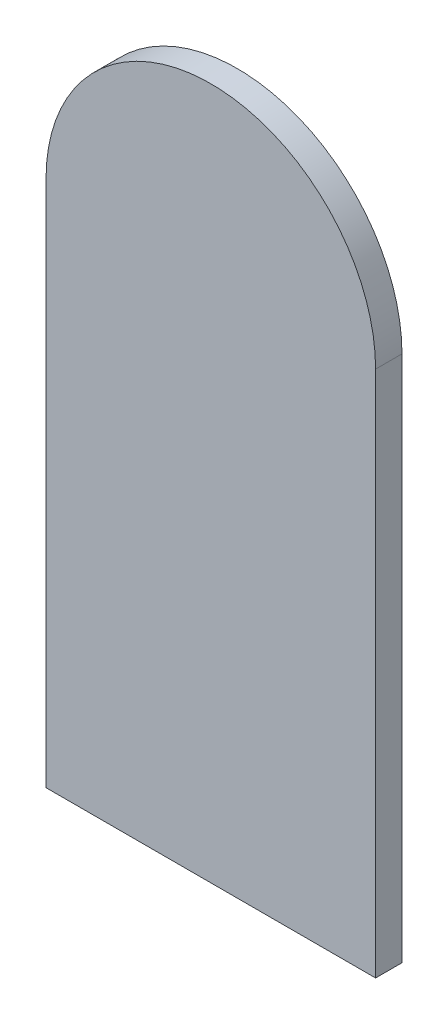
ISO-10303-21;
HEADER;
FILE_DESCRIPTION(('STEP AP214'),'2;1');
FILE_NAME('part.step','',(''),(''),'','','');
FILE_SCHEMA(('AUTOMOTIVE_DESIGN { 1 0 10303 214 1 1 1 1 }'));
ENDSEC;
DATA;
#1=APPLICATION_CONTEXT('core data for automotive mechanical design processes');
#2=APPLICATION_PROTOCOL_DEFINITION('international standard','automotive_design',2000,#1);
#3=PRODUCT_CONTEXT('',#1,'mechanical');
#4=PRODUCT('Part','Part','',(#3));
#5=PRODUCT_RELATED_PRODUCT_CATEGORY('part','',(#4));
#6=PRODUCT_DEFINITION_FORMATION('','',#4);
#7=PRODUCT_DEFINITION_CONTEXT('part definition',#1,'design');
#8=PRODUCT_DEFINITION('design','',#6,#7);
#9=PRODUCT_DEFINITION_SHAPE('','',#8);
#10=(LENGTH_UNIT() NAMED_UNIT(*) SI_UNIT(.MILLI.,.METRE.));
#11=(NAMED_UNIT(*) PLANE_ANGLE_UNIT() SI_UNIT($,.RADIAN.));
#12=(NAMED_UNIT(*) SI_UNIT($,.STERADIAN.) SOLID_ANGLE_UNIT());
#13=UNCERTAINTY_MEASURE_WITH_UNIT(LENGTH_MEASURE(1.E-05),#10,'distance_accuracy_value','');
#14=(GEOMETRIC_REPRESENTATION_CONTEXT(3) GLOBAL_UNCERTAINTY_ASSIGNED_CONTEXT((#13)) GLOBAL_UNIT_ASSIGNED_CONTEXT((#10,
#11,#12)) REPRESENTATION_CONTEXT('',''));
#15=CARTESIAN_POINT('',(0.,0.,0.));
#16=DIRECTION('',(0.,0.,1.));
#17=DIRECTION('',(1.,0.,0.));
#18=AXIS2_PLACEMENT_3D('',#15,#16,#17);
#19=CARTESIAN_POINT('',(0.,0.,1.));
#20=DIRECTION('',(-1.,0.,0.));
#21=DIRECTION('',(0.,0.,1.));
#22=AXIS2_PLACEMENT_3D('',#19,#20,#21);
#23=PLANE('',#22);
#24=DIRECTION('',(0.,1.,0.));
#25=VECTOR('',#24,1.);
#26=CARTESIAN_POINT('',(0.,0.,0.));
#27=LINE('',#26,#25);
#28=CARTESIAN_POINT('',(0.,0.,0.));
#29=VERTEX_POINT('',#28);
#30=CARTESIAN_POINT('',(0.,20.,0.));
#31=VERTEX_POINT('',#30);
#32=EDGE_CURVE('E107',#29,#31,#27,.T.);
#33=ORIENTED_EDGE('',*,*,#32,.T.);
#34=DIRECTION('',(0.,0.,-1.));
#35=VECTOR('',#34,1.);
#36=CARTESIAN_POINT('',(0.,20.,1.));
#37=LINE('',#36,#35);
#38=CARTESIAN_POINT('',(0.,20.,1.));
#39=VERTEX_POINT('',#38);
#40=EDGE_CURVE('E11',#39,#31,#37,.T.);
#41=ORIENTED_EDGE('',*,*,#40,.F.);
#42=DIRECTION('',(0.,1.,0.));
#43=VECTOR('',#42,1.);
#44=CARTESIAN_POINT('',(0.,0.,1.));
#45=LINE('',#44,#43);
#46=CARTESIAN_POINT('',(0.,0.,1.));
#47=VERTEX_POINT('',#46);
#48=EDGE_CURVE('E91',#47,#39,#45,.T.);
#49=ORIENTED_EDGE('',*,*,#48,.F.);
#50=DIRECTION('',(0.,0.,-1.));
#51=VECTOR('',#50,1.);
#52=CARTESIAN_POINT('',(0.,0.,1.));
#53=LINE('',#52,#51);
#54=EDGE_CURVE('E103',#47,#29,#53,.T.);
#55=ORIENTED_EDGE('',*,*,#54,.T.);
#56=EDGE_LOOP('',(#33,#41,#49,#55));
#57=FACE_BOUND('',#56,.T.);
#58=ADVANCED_FACE('F39',(#57),#23,.F.);
#59=CARTESIAN_POINT('',(-6.25,20.,1.));
#60=DIRECTION('',(0.,0.,-1.));
#61=DIRECTION('',(-1.,0.,0.));
#62=AXIS2_PLACEMENT_3D('',#59,#60,#61);
#63=CYLINDRICAL_SURFACE('',#62,6.25);
#64=CARTESIAN_POINT('',(-6.25,20.,0.));
#65=DIRECTION('',(0.,0.,1.));
#66=DIRECTION('',(-1.,0.,0.));
#67=AXIS2_PLACEMENT_3D('',#64,#65,#66);
#68=CIRCLE('',#67,6.25);
#69=CARTESIAN_POINT('',(-12.5,20.,0.));
#70=VERTEX_POINT('',#69);
#71=EDGE_CURVE('E96',#31,#70,#68,.T.);
#72=ORIENTED_EDGE('',*,*,#71,.T.);
#73=DIRECTION('',(0.,0.,-1.));
#74=VECTOR('',#73,1.);
#75=CARTESIAN_POINT('',(-12.5,20.,1.));
#76=LINE('',#75,#74);
#77=CARTESIAN_POINT('',(-12.5,20.,1.));
#78=VERTEX_POINT('',#77);
#79=EDGE_CURVE('E48',#78,#70,#76,.T.);
#80=ORIENTED_EDGE('',*,*,#79,.F.);
#81=CARTESIAN_POINT('',(-6.25,20.,1.));
#82=DIRECTION('',(0.,0.,1.));
#83=DIRECTION('',(-1.,0.,0.));
#84=AXIS2_PLACEMENT_3D('',#81,#82,#83);
#85=CIRCLE('',#84,6.25);
#86=EDGE_CURVE('E86',#39,#78,#85,.T.);
#87=ORIENTED_EDGE('',*,*,#86,.F.);
#88=ORIENTED_EDGE('',*,*,#40,.T.);
#89=EDGE_LOOP('',(#72,#80,#87,#88));
#90=FACE_BOUND('',#89,.T.);
#91=ADVANCED_FACE('F95',(#90),#63,.T.);
#92=CARTESIAN_POINT('',(-12.5,0.,1.));
#93=DIRECTION('',(1.,0.,0.));
#94=DIRECTION('',(0.,0.,-1.));
#95=AXIS2_PLACEMENT_3D('',#92,#93,#94);
#96=PLANE('',#95);
#97=DIRECTION('',(0.,-1.,0.));
#98=VECTOR('',#97,1.);
#99=CARTESIAN_POINT('',(-12.5,0.,0.));
#100=LINE('',#99,#98);
#101=CARTESIAN_POINT('',(-12.5,0.,0.));
#102=VERTEX_POINT('',#101);
#103=EDGE_CURVE('E73',#70,#102,#100,.T.);
#104=ORIENTED_EDGE('',*,*,#103,.T.);
#105=DIRECTION('',(0.,0.,-1.));
#106=VECTOR('',#105,1.);
#107=CARTESIAN_POINT('',(-12.5,0.,1.));
#108=LINE('',#107,#106);
#109=CARTESIAN_POINT('',(-12.5,0.,1.));
#110=VERTEX_POINT('',#109);
#111=EDGE_CURVE('E98',#110,#102,#108,.T.);
#112=ORIENTED_EDGE('',*,*,#111,.F.);
#113=DIRECTION('',(0.,-1.,0.));
#114=VECTOR('',#113,1.);
#115=CARTESIAN_POINT('',(-12.5,0.,1.));
#116=LINE('',#115,#114);
#117=EDGE_CURVE('E89',#78,#110,#116,.T.);
#118=ORIENTED_EDGE('',*,*,#117,.F.);
#119=ORIENTED_EDGE('',*,*,#79,.T.);
#120=EDGE_LOOP('',(#104,#112,#118,#119));
#121=FACE_BOUND('',#120,.T.);
#122=ADVANCED_FACE('F99',(#121),#96,.F.);
#123=CARTESIAN_POINT('',(0.,0.,1.));
#124=DIRECTION('',(0.,1.,0.));
#125=DIRECTION('',(-1.,0.,0.));
#126=AXIS2_PLACEMENT_3D('',#123,#124,#125);
#127=PLANE('',#126);
#128=DIRECTION('',(1.,0.,0.));
#129=VECTOR('',#128,1.);
#130=CARTESIAN_POINT('',(0.,0.,0.));
#131=LINE('',#130,#129);
#132=EDGE_CURVE('E79',#102,#29,#131,.T.);
#133=ORIENTED_EDGE('',*,*,#132,.T.);
#134=ORIENTED_EDGE('',*,*,#54,.F.);
#135=DIRECTION('',(1.,0.,0.));
#136=VECTOR('',#135,1.);
#137=CARTESIAN_POINT('',(0.,0.,1.));
#138=LINE('',#137,#136);
#139=EDGE_CURVE('E56',#110,#47,#138,.T.);
#140=ORIENTED_EDGE('',*,*,#139,.F.);
#141=ORIENTED_EDGE('',*,*,#111,.T.);
#142=EDGE_LOOP('',(#133,#134,#140,#141));
#143=FACE_BOUND('',#142,.T.);
#144=ADVANCED_FACE('F120',(#143),#127,.F.);
#145=CARTESIAN_POINT('',(-6.25,20.,1.));
#146=DIRECTION('',(0.,0.,-1.));
#147=DIRECTION('',(-1.,0.,0.));
#148=AXIS2_PLACEMENT_3D('',#145,#146,#147);
#149=PLANE('',#148);
#150=ORIENTED_EDGE('',*,*,#48,.T.);
#151=ORIENTED_EDGE('',*,*,#86,.T.);
#152=ORIENTED_EDGE('',*,*,#117,.T.);
#153=ORIENTED_EDGE('',*,*,#139,.T.);
#154=EDGE_LOOP('',(#150,#151,#152,#153));
#155=FACE_BOUND('',#154,.T.);
#156=ADVANCED_FACE('F87',(#155),#149,.F.);
#157=CARTESIAN_POINT('',(-6.25,20.,0.));
#158=DIRECTION('',(0.,0.,-1.));
#159=DIRECTION('',(-1.,0.,0.));
#160=AXIS2_PLACEMENT_3D('',#157,#158,#159);
#161=PLANE('',#160);
#162=ORIENTED_EDGE('',*,*,#32,.F.);
#163=ORIENTED_EDGE('',*,*,#132,.F.);
#164=ORIENTED_EDGE('',*,*,#103,.F.);
#165=ORIENTED_EDGE('',*,*,#71,.F.);
#166=EDGE_LOOP('',(#162,#163,#164,#165));
#167=FACE_BOUND('',#166,.T.);
#168=ADVANCED_FACE('F123',(#167),#161,.T.);
#169=CLOSED_SHELL('',(#58,#91,#122,#144,#156,#168));
#170=MANIFOLD_SOLID_BREP('B2',#169);
#171=ADVANCED_BREP_SHAPE_REPRESENTATION('',(#18,#170),#14);
#172=SHAPE_DEFINITION_REPRESENTATION(#9,#171);
ENDSEC;
END-ISO-10303-21;
